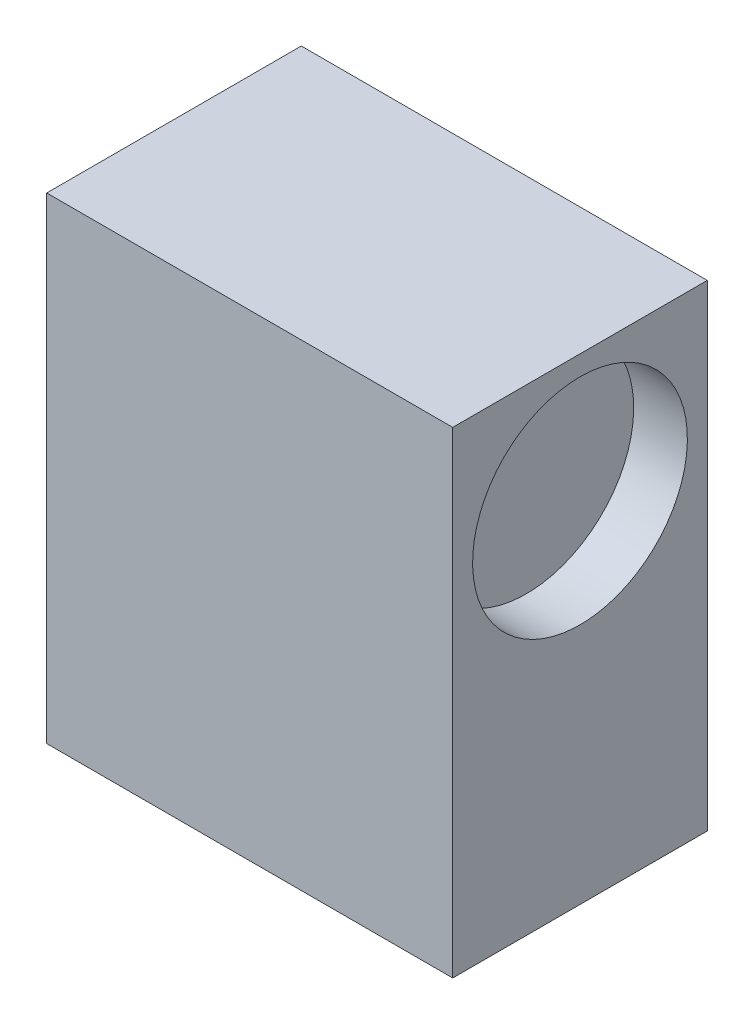
ISO-10303-21;
HEADER;
FILE_DESCRIPTION(('STEP AP214'),'2;1');
FILE_NAME('part.step','',(''),(''),'','','');
FILE_SCHEMA(('AUTOMOTIVE_DESIGN { 1 0 10303 214 1 1 1 1 }'));
ENDSEC;
DATA;
#1=APPLICATION_CONTEXT('core data for automotive mechanical design processes');
#2=APPLICATION_PROTOCOL_DEFINITION('international standard','automotive_design',2000,#1);
#3=PRODUCT_CONTEXT('',#1,'mechanical');
#4=PRODUCT('Part','Part','',(#3));
#5=PRODUCT_RELATED_PRODUCT_CATEGORY('part','',(#4));
#6=PRODUCT_DEFINITION_FORMATION('','',#4);
#7=PRODUCT_DEFINITION_CONTEXT('part definition',#1,'design');
#8=PRODUCT_DEFINITION('design','',#6,#7);
#9=PRODUCT_DEFINITION_SHAPE('','',#8);
#10=(LENGTH_UNIT() NAMED_UNIT(*) SI_UNIT(.MILLI.,.METRE.));
#11=(NAMED_UNIT(*) PLANE_ANGLE_UNIT() SI_UNIT($,.RADIAN.));
#12=(NAMED_UNIT(*) SI_UNIT($,.STERADIAN.) SOLID_ANGLE_UNIT());
#13=UNCERTAINTY_MEASURE_WITH_UNIT(LENGTH_MEASURE(1.E-05),#10,'distance_accuracy_value','');
#14=(GEOMETRIC_REPRESENTATION_CONTEXT(3) GLOBAL_UNCERTAINTY_ASSIGNED_CONTEXT((#13)) GLOBAL_UNIT_ASSIGNED_CONTEXT((#10,
#11,#12)) REPRESENTATION_CONTEXT('',''));
#15=CARTESIAN_POINT('',(0.,0.,0.));
#16=DIRECTION('',(0.,0.,1.));
#17=DIRECTION('',(1.,0.,0.));
#18=AXIS2_PLACEMENT_3D('',#15,#16,#17);
#19=CARTESIAN_POINT('',(-3.65090909090909,15.2881818181818,23.7));
#20=DIRECTION('',(1.,0.,0.));
#21=DIRECTION('',(0.,1.,0.));
#22=AXIS2_PLACEMENT_3D('',#19,#20,#21);
#23=PLANE('',#22);
#24=CARTESIAN_POINT('',(-3.65090909090909,3.43818181818181,11.85));
#25=DIRECTION('',(1.,0.,0.));
#26=DIRECTION('',(0.,1.,0.));
#27=AXIS2_PLACEMENT_3D('',#24,#25,#26);
#28=CIRCLE('',#27,10.);
#29=CARTESIAN_POINT('',(-3.65090909090909,13.4381818181818,11.85));
#30=VERTEX_POINT('',#29);
#31=EDGE_CURVE('E124',#30,#30,#28,.T.);
#32=ORIENTED_EDGE('',*,*,#31,.T.);
#33=EDGE_LOOP('',(#32));
#34=FACE_BOUND('',#33,.T.);
#35=DIRECTION('',(0.,-1.,0.));
#36=VECTOR('',#35,1.);
#37=CARTESIAN_POINT('',(-3.65090909090909,15.2881818181818,0.));
#38=LINE('',#37,#36);
#39=CARTESIAN_POINT('',(-3.65090909090909,15.2881818181818,0.));
#40=VERTEX_POINT('',#39);
#41=CARTESIAN_POINT('',(-3.65090909090909,-29.1118181818182,0.));
#42=VERTEX_POINT('',#41);
#43=EDGE_CURVE('E104',#40,#42,#38,.T.);
#44=ORIENTED_EDGE('',*,*,#43,.T.);
#45=DIRECTION('',(0.,0.,-1.));
#46=VECTOR('',#45,1.);
#47=CARTESIAN_POINT('',(-3.65090909090909,-29.1118181818182,23.7));
#48=LINE('',#47,#46);
#49=CARTESIAN_POINT('',(-3.65090909090909,-29.1118181818182,23.7));
#50=VERTEX_POINT('',#49);
#51=EDGE_CURVE('E11',#50,#42,#48,.T.);
#52=ORIENTED_EDGE('',*,*,#51,.F.);
#53=DIRECTION('',(0.,-1.,0.));
#54=VECTOR('',#53,1.);
#55=CARTESIAN_POINT('',(-3.65090909090909,15.2881818181818,23.7));
#56=LINE('',#55,#54);
#57=CARTESIAN_POINT('',(-3.65090909090909,15.2881818181818,23.7));
#58=VERTEX_POINT('',#57);
#59=EDGE_CURVE('E92',#58,#50,#56,.T.);
#60=ORIENTED_EDGE('',*,*,#59,.F.);
#61=DIRECTION('',(0.,0.,-1.));
#62=VECTOR('',#61,1.);
#63=CARTESIAN_POINT('',(-3.65090909090909,15.2881818181818,23.7));
#64=LINE('',#63,#62);
#65=EDGE_CURVE('E100',#58,#40,#64,.T.);
#66=ORIENTED_EDGE('',*,*,#65,.T.);
#67=EDGE_LOOP('',(#44,#52,#60,#66));
#68=FACE_BOUND('',#67,.T.);
#69=ADVANCED_FACE('F41',(#34,#68),#23,.F.);
#70=CARTESIAN_POINT('',(-3.65090909090909,-29.1118181818182,23.7));
#71=DIRECTION('',(0.,1.,0.));
#72=DIRECTION('',(0.,0.,1.));
#73=AXIS2_PLACEMENT_3D('',#70,#71,#72);
#74=PLANE('',#73);
#75=DIRECTION('',(1.,0.,0.));
#76=VECTOR('',#75,1.);
#77=CARTESIAN_POINT('',(-3.65090909090909,-29.1118181818182,0.));
#78=LINE('',#77,#76);
#79=CARTESIAN_POINT('',(34.1490909090909,-29.1118181818182,0.));
#80=VERTEX_POINT('',#79);
#81=EDGE_CURVE('E96',#42,#80,#78,.T.);
#82=ORIENTED_EDGE('',*,*,#81,.T.);
#83=DIRECTION('',(0.,0.,-1.));
#84=VECTOR('',#83,1.);
#85=CARTESIAN_POINT('',(34.1490909090909,-29.1118181818182,23.7));
#86=LINE('',#85,#84);
#87=CARTESIAN_POINT('',(34.1490909090909,-29.1118181818182,23.7));
#88=VERTEX_POINT('',#87);
#89=EDGE_CURVE('E49',#88,#80,#86,.T.);
#90=ORIENTED_EDGE('',*,*,#89,.F.);
#91=DIRECTION('',(1.,0.,0.));
#92=VECTOR('',#91,1.);
#93=CARTESIAN_POINT('',(-3.65090909090909,-29.1118181818182,23.7));
#94=LINE('',#93,#92);
#95=EDGE_CURVE('E87',#50,#88,#94,.T.);
#96=ORIENTED_EDGE('',*,*,#95,.F.);
#97=ORIENTED_EDGE('',*,*,#51,.T.);
#98=EDGE_LOOP('',(#82,#90,#96,#97));
#99=FACE_BOUND('',#98,.T.);
#100=ADVANCED_FACE('F95',(#99),#74,.F.);
#101=CARTESIAN_POINT('',(34.1490909090909,15.2881818181818,23.7));
#102=DIRECTION('',(-1.,0.,0.));
#103=DIRECTION('',(0.,-1.,0.));
#104=AXIS2_PLACEMENT_3D('',#101,#102,#103);
#105=PLANE('',#104);
#106=CARTESIAN_POINT('',(34.1490909090909,3.43818181818182,11.85));
#107=DIRECTION('',(1.,0.,0.));
#108=DIRECTION('',(0.,1.,0.));
#109=AXIS2_PLACEMENT_3D('',#106,#107,#108);
#110=CIRCLE('',#109,10.);
#111=CARTESIAN_POINT('',(34.1490909090909,13.4381818181818,11.85));
#112=VERTEX_POINT('',#111);
#113=EDGE_CURVE('E118',#112,#112,#110,.T.);
#114=ORIENTED_EDGE('',*,*,#113,.F.);
#115=EDGE_LOOP('',(#114));
#116=FACE_BOUND('',#115,.T.);
#117=DIRECTION('',(0.,1.,0.));
#118=VECTOR('',#117,1.);
#119=CARTESIAN_POINT('',(34.1490909090909,15.2881818181818,0.));
#120=LINE('',#119,#118);
#121=CARTESIAN_POINT('',(34.1490909090909,15.2881818181818,0.));
#122=VERTEX_POINT('',#121);
#123=EDGE_CURVE('E74',#80,#122,#120,.T.);
#124=ORIENTED_EDGE('',*,*,#123,.T.);
#125=DIRECTION('',(0.,0.,-1.));
#126=VECTOR('',#125,1.);
#127=CARTESIAN_POINT('',(34.1490909090909,15.2881818181818,23.7));
#128=LINE('',#127,#126);
#129=CARTESIAN_POINT('',(34.1490909090909,15.2881818181818,23.7));
#130=VERTEX_POINT('',#129);
#131=EDGE_CURVE('E97',#130,#122,#128,.T.);
#132=ORIENTED_EDGE('',*,*,#131,.F.);
#133=DIRECTION('',(0.,1.,0.));
#134=VECTOR('',#133,1.);
#135=CARTESIAN_POINT('',(34.1490909090909,15.2881818181818,23.7));
#136=LINE('',#135,#134);
#137=EDGE_CURVE('E90',#88,#130,#136,.T.);
#138=ORIENTED_EDGE('',*,*,#137,.F.);
#139=ORIENTED_EDGE('',*,*,#89,.T.);
#140=EDGE_LOOP('',(#124,#132,#138,#139));
#141=FACE_BOUND('',#140,.T.);
#142=ADVANCED_FACE('F98',(#116,#141),#105,.F.);
#143=CARTESIAN_POINT('',(-3.65090909090909,15.2881818181818,23.7));
#144=DIRECTION('',(0.,-1.,0.));
#145=DIRECTION('',(0.,0.,-1.));
#146=AXIS2_PLACEMENT_3D('',#143,#144,#145);
#147=PLANE('',#146);
#148=DIRECTION('',(-1.,0.,0.));
#149=VECTOR('',#148,1.);
#150=CARTESIAN_POINT('',(-3.65090909090909,15.2881818181818,0.));
#151=LINE('',#150,#149);
#152=EDGE_CURVE('E80',#122,#40,#151,.T.);
#153=ORIENTED_EDGE('',*,*,#152,.T.);
#154=ORIENTED_EDGE('',*,*,#65,.F.);
#155=DIRECTION('',(-1.,0.,0.));
#156=VECTOR('',#155,1.);
#157=CARTESIAN_POINT('',(-3.65090909090909,15.2881818181818,23.7));
#158=LINE('',#157,#156);
#159=EDGE_CURVE('E57',#130,#58,#158,.T.);
#160=ORIENTED_EDGE('',*,*,#159,.F.);
#161=ORIENTED_EDGE('',*,*,#131,.T.);
#162=EDGE_LOOP('',(#153,#154,#160,#161));
#163=FACE_BOUND('',#162,.T.);
#164=ADVANCED_FACE('F112',(#163),#147,.F.);
#165=CARTESIAN_POINT('',(0.,0.,23.7));
#166=DIRECTION('',(0.,0.,1.));
#167=DIRECTION('',(1.,0.,0.));
#168=AXIS2_PLACEMENT_3D('',#165,#166,#167);
#169=PLANE('',#168);
#170=ORIENTED_EDGE('',*,*,#59,.T.);
#171=ORIENTED_EDGE('',*,*,#95,.T.);
#172=ORIENTED_EDGE('',*,*,#137,.T.);
#173=ORIENTED_EDGE('',*,*,#159,.T.);
#174=EDGE_LOOP('',(#170,#171,#172,#173));
#175=FACE_BOUND('',#174,.T.);
#176=ADVANCED_FACE('F88',(#175),#169,.T.);
#177=CARTESIAN_POINT('',(0.,0.,0.));
#178=DIRECTION('',(0.,0.,1.));
#179=DIRECTION('',(1.,0.,0.));
#180=AXIS2_PLACEMENT_3D('',#177,#178,#179);
#181=PLANE('',#180);
#182=ORIENTED_EDGE('',*,*,#43,.F.);
#183=ORIENTED_EDGE('',*,*,#152,.F.);
#184=ORIENTED_EDGE('',*,*,#123,.F.);
#185=ORIENTED_EDGE('',*,*,#81,.F.);
#186=EDGE_LOOP('',(#182,#183,#184,#185));
#187=FACE_BOUND('',#186,.T.);
#188=ADVANCED_FACE('F115',(#187),#181,.F.);
#189=CARTESIAN_POINT('',(29.1490909090909,3.43818181818181,11.85));
#190=DIRECTION('',(1.,0.,0.));
#191=DIRECTION('',(0.,1.,0.));
#192=AXIS2_PLACEMENT_3D('',#189,#190,#191);
#193=CYLINDRICAL_SURFACE('',#192,10.);
#194=CARTESIAN_POINT('',(29.1490909090909,3.43818181818181,11.85));
#195=DIRECTION('',(1.,0.,0.));
#196=DIRECTION('',(0.,1.,0.));
#197=AXIS2_PLACEMENT_3D('',#194,#195,#196);
#198=CIRCLE('',#197,10.);
#199=CARTESIAN_POINT('',(29.1490909090909,13.4381818181818,11.85));
#200=VERTEX_POINT('',#199);
#201=EDGE_CURVE('E107',#200,#200,#198,.T.);
#202=ORIENTED_EDGE('',*,*,#201,.F.);
#203=EDGE_LOOP('',(#202));
#204=FACE_BOUND('',#203,.T.);
#205=ORIENTED_EDGE('',*,*,#113,.T.);
#206=EDGE_LOOP('',(#205));
#207=FACE_BOUND('',#206,.T.);
#208=ADVANCED_FACE('F157',(#204,#207),#193,.F.);
#209=CARTESIAN_POINT('',(29.1490909090909,3.43818181818181,11.85));
#210=DIRECTION('',(1.,0.,0.));
#211=DIRECTION('',(0.,1.,0.));
#212=AXIS2_PLACEMENT_3D('',#209,#210,#211);
#213=PLANE('',#212);
#214=ORIENTED_EDGE('',*,*,#201,.T.);
#215=EDGE_LOOP('',(#214));
#216=FACE_BOUND('',#215,.T.);
#217=ADVANCED_FACE('F139',(#216),#213,.T.);
#218=CARTESIAN_POINT('',(1.34909090909091,3.43818181818181,11.85));
#219=DIRECTION('',(-1.,0.,0.));
#220=DIRECTION('',(0.,-1.,0.));
#221=AXIS2_PLACEMENT_3D('',#218,#219,#220);
#222=CYLINDRICAL_SURFACE('',#221,10.);
#223=CARTESIAN_POINT('',(1.34909090909091,3.43818181818181,11.85));
#224=DIRECTION('',(1.,0.,0.));
#225=DIRECTION('',(0.,1.,0.));
#226=AXIS2_PLACEMENT_3D('',#223,#224,#225);
#227=CIRCLE('',#226,10.);
#228=CARTESIAN_POINT('',(1.34909090909091,13.4381818181818,11.85));
#229=VERTEX_POINT('',#228);
#230=EDGE_CURVE('E121',#229,#229,#227,.T.);
#231=ORIENTED_EDGE('',*,*,#230,.T.);
#232=EDGE_LOOP('',(#231));
#233=FACE_BOUND('',#232,.T.);
#234=ORIENTED_EDGE('',*,*,#31,.F.);
#235=EDGE_LOOP('',(#234));
#236=FACE_BOUND('',#235,.T.);
#237=ADVANCED_FACE('F130',(#233,#236),#222,.F.);
#238=CARTESIAN_POINT('',(1.34909090909091,3.43818181818181,11.85));
#239=DIRECTION('',(-1.,0.,0.));
#240=DIRECTION('',(0.,1.,0.));
#241=AXIS2_PLACEMENT_3D('',#238,#239,#240);
#242=PLANE('',#241);
#243=ORIENTED_EDGE('',*,*,#230,.F.);
#244=EDGE_LOOP('',(#243));
#245=FACE_BOUND('',#244,.T.);
#246=ADVANCED_FACE('F133',(#245),#242,.T.);
#247=CLOSED_SHELL('',(#69,#100,#142,#164,#176,#188,#208,#217,#237,#246));
#248=MANIFOLD_SOLID_BREP('B2',#247);
#249=ADVANCED_BREP_SHAPE_REPRESENTATION('',(#18,#248),#14);
#250=SHAPE_DEFINITION_REPRESENTATION(#9,#249);
ENDSEC;
END-ISO-10303-21;
